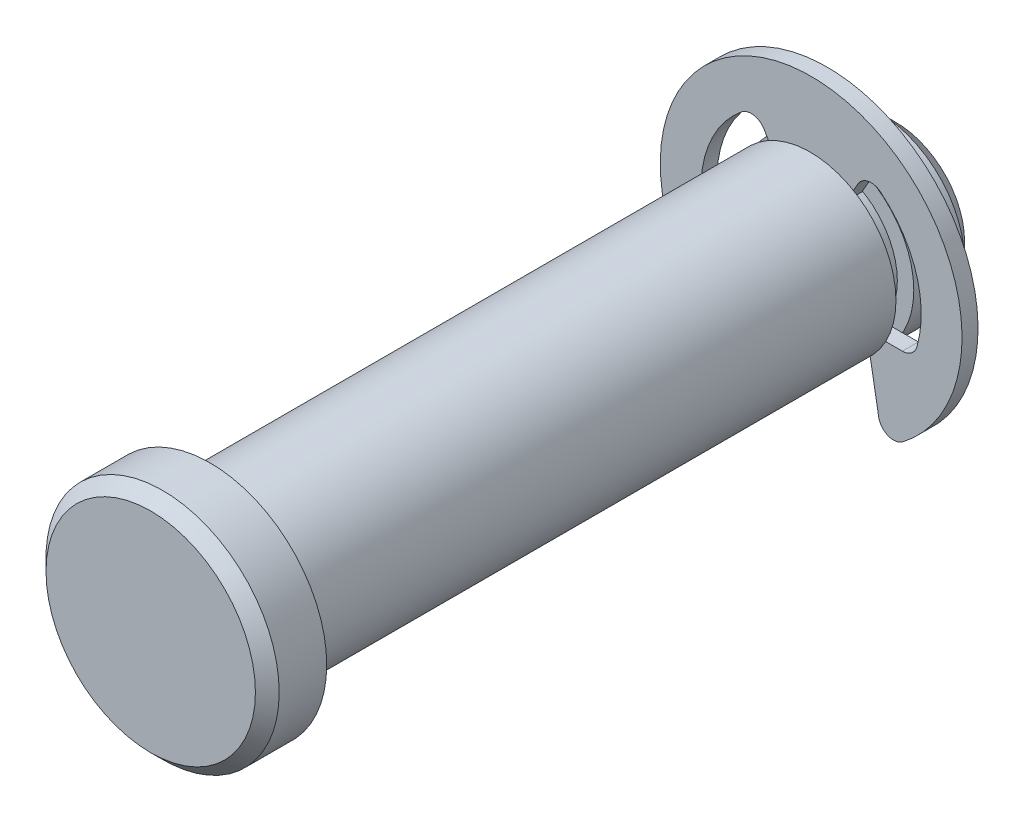
ISO-10303-21;
HEADER;
FILE_DESCRIPTION(('STEP AP214'),'2;1');
FILE_NAME('part.step','',(''),(''),'','','');
FILE_SCHEMA(('AUTOMOTIVE_DESIGN { 1 0 10303 214 1 1 1 1 }'));
ENDSEC;
DATA;
#1=APPLICATION_CONTEXT('core data for automotive mechanical design processes');
#2=APPLICATION_PROTOCOL_DEFINITION('international standard','automotive_design',2000,#1);
#3=PRODUCT_CONTEXT('',#1,'mechanical');
#4=PRODUCT('Part','Part','',(#3));
#5=PRODUCT_RELATED_PRODUCT_CATEGORY('part','',(#4));
#6=PRODUCT_DEFINITION_FORMATION('','',#4);
#7=PRODUCT_DEFINITION_CONTEXT('part definition',#1,'design');
#8=PRODUCT_DEFINITION('design','',#6,#7);
#9=PRODUCT_DEFINITION_SHAPE('','',#8);
#10=(LENGTH_UNIT() NAMED_UNIT(*) SI_UNIT(.MILLI.,.METRE.));
#11=(NAMED_UNIT(*) PLANE_ANGLE_UNIT() SI_UNIT($,.RADIAN.));
#12=(NAMED_UNIT(*) SI_UNIT($,.STERADIAN.) SOLID_ANGLE_UNIT());
#13=UNCERTAINTY_MEASURE_WITH_UNIT(LENGTH_MEASURE(1.E-05),#10,'distance_accuracy_value','');
#14=(GEOMETRIC_REPRESENTATION_CONTEXT(3) GLOBAL_UNCERTAINTY_ASSIGNED_CONTEXT((#13)) GLOBAL_UNIT_ASSIGNED_CONTEXT((#10,
#11,#12)) REPRESENTATION_CONTEXT('',''));
#15=CARTESIAN_POINT('',(0.,0.,0.));
#16=DIRECTION('',(0.,0.,1.));
#17=DIRECTION('',(1.,0.,0.));
#18=AXIS2_PLACEMENT_3D('',#15,#16,#17);
#19=CARTESIAN_POINT('',(0.,0.,-14.3383));
#20=DIRECTION('',(0.,0.,1.));
#21=DIRECTION('',(1.,0.,0.));
#22=AXIS2_PLACEMENT_3D('',#19,#20,#21);
#23=PLANE('',#22);
#24=DIRECTION('',(-0.173648177666931,0.984807753012208,0.));
#25=VECTOR('',#24,1.);
#26=CARTESIAN_POINT('',(2.59081415555905,0.45683043762648,-14.3383));
#27=LINE('',#26,#25);
#28=CARTESIAN_POINT('',(3.7540636467653,-6.14028525353106,-14.3383));
#29=VERTEX_POINT('',#28);
#30=CARTESIAN_POINT('',(3.07848,-2.30886,-14.3383));
#31=VERTEX_POINT('',#30);
#32=EDGE_CURVE('E200',#29,#31,#27,.T.);
#33=ORIENTED_EDGE('',*,*,#32,.F.);
#34=CARTESIAN_POINT('',(4.57952950534013,-5.99473335101063,-14.3383));
#35=DIRECTION('',(0.,0.,1.));
#36=DIRECTION('',(1.,0.,0.));
#37=AXIS2_PLACEMENT_3D('',#34,#35,#36);
#38=CIRCLE('',#37,0.8382);
#39=CARTESIAN_POINT('',(5.08836611704459,-6.66081483445626,-14.3383));
#40=VERTEX_POINT('',#39);
#41=EDGE_CURVE('E254',#29,#40,#38,.T.);
#42=ORIENTED_EDGE('',*,*,#41,.T.);
#43=CARTESIAN_POINT('',(0.,0.,-14.3383));
#44=DIRECTION('',(0.,0.,1.));
#45=DIRECTION('',(1.,0.,0.));
#46=AXIS2_PLACEMENT_3D('',#43,#44,#45);
#47=CIRCLE('',#46,8.382);
#48=CARTESIAN_POINT('',(-5.08836611704459,-6.66081483445626,-14.3383));
#49=VERTEX_POINT('',#48);
#50=EDGE_CURVE('E180',#40,#49,#47,.T.);
#51=ORIENTED_EDGE('',*,*,#50,.T.);
#52=CARTESIAN_POINT('',(-4.57952950534013,-5.99473335101063,-14.3383));
#53=DIRECTION('',(0.,0.,1.));
#54=DIRECTION('',(1.,0.,0.));
#55=AXIS2_PLACEMENT_3D('',#52,#53,#54);
#56=CIRCLE('',#55,0.8382);
#57=CARTESIAN_POINT('',(-3.7540636467653,-6.14028525353106,-14.3383));
#58=VERTEX_POINT('',#57);
#59=EDGE_CURVE('E252',#49,#58,#56,.T.);
#60=ORIENTED_EDGE('',*,*,#59,.T.);
#61=DIRECTION('',(-0.173648177666931,-0.984807753012208,0.));
#62=VECTOR('',#61,1.);
#63=CARTESIAN_POINT('',(-2.59081415555905,0.45683043762648,-14.3383));
#64=LINE('',#63,#62);
#65=CARTESIAN_POINT('',(-3.07848,-2.30886,-14.3383));
#66=VERTEX_POINT('',#65);
#67=EDGE_CURVE('E196',#66,#58,#64,.T.);
#68=ORIENTED_EDGE('',*,*,#67,.F.);
#69=DIRECTION('',(1.,0.,0.));
#70=VECTOR('',#69,1.);
#71=CARTESIAN_POINT('',(0.,-2.30886,-14.3383));
#72=LINE('',#71,#70);
#73=CARTESIAN_POINT('',(-5.06777121493265,-2.30886,-14.3383));
#74=VERTEX_POINT('',#73);
#75=EDGE_CURVE('E187',#74,#66,#72,.T.);
#76=ORIENTED_EDGE('',*,*,#75,.F.);
#77=CARTESIAN_POINT('',(-5.06777121493265,-1.47066,-14.3383));
#78=DIRECTION('',(0.,0.,1.));
#79=DIRECTION('',(1.,0.,0.));
#80=AXIS2_PLACEMENT_3D('',#77,#78,#79);
#81=CIRCLE('',#80,0.8382);
#82=CARTESIAN_POINT('',(-5.87276014438044,-1.70426664259928,-14.3383));
#83=VERTEX_POINT('',#82);
#84=EDGE_CURVE('E52',#74,#83,#81,.F.);
#85=ORIENTED_EDGE('',*,*,#84,.T.);
#86=CARTESIAN_POINT('',(0.,0.,-14.3383));
#87=DIRECTION('',(0.,0.,1.));
#88=DIRECTION('',(1.,0.,0.));
#89=AXIS2_PLACEMENT_3D('',#86,#87,#88);
#90=CIRCLE('',#89,6.11505);
#91=CARTESIAN_POINT('',(-3.85991365439078,4.74287919761273,-14.3383));
#92=VERTEX_POINT('',#91);
#93=EDGE_CURVE('E212',#92,#83,#90,.T.);
#94=ORIENTED_EDGE('',*,*,#93,.F.);
#95=CARTESIAN_POINT('',(-3.33082891671728,4.09276491507392,-14.3383));
#96=DIRECTION('',(0.,0.,1.));
#97=DIRECTION('',(1.,0.,0.));
#98=AXIS2_PLACEMENT_3D('',#95,#96,#97);
#99=CIRCLE('',#98,0.8382);
#100=CARTESIAN_POINT('',(-2.60492642326516,4.51186491507392,-14.3383));
#101=VERTEX_POINT('',#100);
#102=EDGE_CURVE('E184',#92,#101,#99,.F.);
#103=ORIENTED_EDGE('',*,*,#102,.T.);
#104=DIRECTION('',(-0.500000000000001,0.866025403784438,0.));
#105=VECTOR('',#104,1.);
#106=CARTESIAN_POINT('',(0.,0.,-14.3383));
#107=LINE('',#106,#105);
#108=CARTESIAN_POINT('',(-1.92405000000001,3.33255235630289,-14.3383));
#109=VERTEX_POINT('',#108);
#110=EDGE_CURVE('E176',#109,#101,#107,.T.);
#111=ORIENTED_EDGE('',*,*,#110,.F.);
#112=DIRECTION('',(1.,0.,0.));
#113=VECTOR('',#112,1.);
#114=CARTESIAN_POINT('',(-1.92405000000001,3.33255235630289,-14.3383));
#115=LINE('',#114,#113);
#116=CARTESIAN_POINT('',(1.92405000000001,3.33255235630289,-14.3383));
#117=VERTEX_POINT('',#116);
#118=EDGE_CURVE('E160',#109,#117,#115,.T.);
#119=ORIENTED_EDGE('',*,*,#118,.T.);
#120=DIRECTION('',(-0.500000000000001,-0.866025403784438,0.));
#121=VECTOR('',#120,1.);
#122=CARTESIAN_POINT('',(0.,0.,-14.3383));
#123=LINE('',#122,#121);
#124=CARTESIAN_POINT('',(2.60492642326516,4.51186491507392,-14.3383));
#125=VERTEX_POINT('',#124);
#126=EDGE_CURVE('E210',#125,#117,#123,.T.);
#127=ORIENTED_EDGE('',*,*,#126,.F.);
#128=CARTESIAN_POINT('',(3.33082891671728,4.09276491507392,-14.3383));
#129=DIRECTION('',(0.,0.,1.));
#130=DIRECTION('',(1.,0.,0.));
#131=AXIS2_PLACEMENT_3D('',#128,#129,#130);
#132=CIRCLE('',#131,0.8382);
#133=CARTESIAN_POINT('',(3.85991365439078,4.74287919761273,-14.3383));
#134=VERTEX_POINT('',#133);
#135=EDGE_CURVE('E269',#125,#134,#132,.F.);
#136=ORIENTED_EDGE('',*,*,#135,.T.);
#137=CARTESIAN_POINT('',(0.,0.,-14.3383));
#138=DIRECTION('',(0.,0.,1.));
#139=DIRECTION('',(1.,0.,0.));
#140=AXIS2_PLACEMENT_3D('',#137,#138,#139);
#141=CIRCLE('',#140,6.11505);
#142=CARTESIAN_POINT('',(5.87276014438044,-1.70426664259928,-14.3383));
#143=VERTEX_POINT('',#142);
#144=EDGE_CURVE('E215',#143,#134,#141,.T.);
#145=ORIENTED_EDGE('',*,*,#144,.F.);
#146=CARTESIAN_POINT('',(5.06777121493265,-1.47066,-14.3383));
#147=DIRECTION('',(0.,0.,1.));
#148=DIRECTION('',(1.,0.,0.));
#149=AXIS2_PLACEMENT_3D('',#146,#147,#148);
#150=CIRCLE('',#149,0.8382);
#151=CARTESIAN_POINT('',(5.06777121493265,-2.30886,-14.3383));
#152=VERTEX_POINT('',#151);
#153=EDGE_CURVE('E265',#143,#152,#150,.F.);
#154=ORIENTED_EDGE('',*,*,#153,.T.);
#155=DIRECTION('',(1.,0.,0.));
#156=VECTOR('',#155,1.);
#157=CARTESIAN_POINT('',(0.,-2.30886,-14.3383));
#158=LINE('',#157,#156);
#159=EDGE_CURVE('E205',#31,#152,#158,.T.);
#160=ORIENTED_EDGE('',*,*,#159,.F.);
#161=EDGE_LOOP('',(#33,#42,#51,#60,#68,#76,#85,#94,#103,#111,#119,#127,#136,#145,#154,#160));
#162=FACE_BOUND('',#161,.T.);
#163=ADVANCED_FACE('F44',(#162),#23,.T.);
#164=CARTESIAN_POINT('',(0.,0.,-15.2273));
#165=DIRECTION('',(0.,0.,1.));
#166=DIRECTION('',(1.,0.,0.));
#167=AXIS2_PLACEMENT_3D('',#164,#165,#166);
#168=PLANE('',#167);
#169=CARTESIAN_POINT('',(0.,0.,-15.2273));
#170=DIRECTION('',(0.,0.,1.));
#171=DIRECTION('',(1.,0.,0.));
#172=AXIS2_PLACEMENT_3D('',#169,#170,#171);
#173=CIRCLE('',#172,8.382);
#174=CARTESIAN_POINT('',(5.08836611704459,-6.66081483445626,-15.2273));
#175=VERTEX_POINT('',#174);
#176=CARTESIAN_POINT('',(-5.08836611704459,-6.66081483445626,-15.2273));
#177=VERTEX_POINT('',#176);
#178=EDGE_CURVE('E218',#175,#177,#173,.T.);
#179=ORIENTED_EDGE('',*,*,#178,.F.);
#180=CARTESIAN_POINT('',(4.57952950534013,-5.99473335101063,-15.2273));
#181=DIRECTION('',(0.,0.,1.));
#182=DIRECTION('',(1.,0.,0.));
#183=AXIS2_PLACEMENT_3D('',#180,#181,#182);
#184=CIRCLE('',#183,0.8382);
#185=CARTESIAN_POINT('',(3.7540636467653,-6.14028525353106,-15.2273));
#186=VERTEX_POINT('',#185);
#187=EDGE_CURVE('E262',#175,#186,#184,.F.);
#188=ORIENTED_EDGE('',*,*,#187,.T.);
#189=DIRECTION('',(-0.173648177666931,0.984807753012208,0.));
#190=VECTOR('',#189,1.);
#191=CARTESIAN_POINT('',(2.59081415555905,0.45683043762648,-15.2273));
#192=LINE('',#191,#190);
#193=CARTESIAN_POINT('',(3.07848,-2.30886,-15.2273));
#194=VERTEX_POINT('',#193);
#195=EDGE_CURVE('E198',#186,#194,#192,.T.);
#196=ORIENTED_EDGE('',*,*,#195,.T.);
#197=DIRECTION('',(1.,0.,0.));
#198=VECTOR('',#197,1.);
#199=CARTESIAN_POINT('',(0.,-2.30886,-15.2273));
#200=LINE('',#199,#198);
#201=CARTESIAN_POINT('',(5.06777121493265,-2.30886,-15.2273));
#202=VERTEX_POINT('',#201);
#203=EDGE_CURVE('E202',#194,#202,#200,.T.);
#204=ORIENTED_EDGE('',*,*,#203,.T.);
#205=CARTESIAN_POINT('',(5.06777121493265,-1.47066,-15.2273));
#206=DIRECTION('',(0.,0.,1.));
#207=DIRECTION('',(1.,0.,0.));
#208=AXIS2_PLACEMENT_3D('',#205,#206,#207);
#209=CIRCLE('',#208,0.8382);
#210=CARTESIAN_POINT('',(5.87276014438044,-1.70426664259928,-15.2273));
#211=VERTEX_POINT('',#210);
#212=EDGE_CURVE('E267',#202,#211,#209,.T.);
#213=ORIENTED_EDGE('',*,*,#212,.T.);
#214=CARTESIAN_POINT('',(0.,0.,-15.2273));
#215=DIRECTION('',(0.,0.,1.));
#216=DIRECTION('',(1.,0.,0.));
#217=AXIS2_PLACEMENT_3D('',#214,#215,#216);
#218=CIRCLE('',#217,6.11505);
#219=CARTESIAN_POINT('',(3.85991365439078,4.74287919761273,-15.2273));
#220=VERTEX_POINT('',#219);
#221=EDGE_CURVE('E226',#211,#220,#218,.T.);
#222=ORIENTED_EDGE('',*,*,#221,.T.);
#223=CARTESIAN_POINT('',(3.33082891671728,4.09276491507392,-15.2273));
#224=DIRECTION('',(0.,0.,1.));
#225=DIRECTION('',(1.,0.,0.));
#226=AXIS2_PLACEMENT_3D('',#223,#224,#225);
#227=CIRCLE('',#226,0.8382);
#228=CARTESIAN_POINT('',(2.60492642326516,4.51186491507392,-15.2273));
#229=VERTEX_POINT('',#228);
#230=EDGE_CURVE('E271',#220,#229,#227,.T.);
#231=ORIENTED_EDGE('',*,*,#230,.T.);
#232=DIRECTION('',(-0.500000000000001,-0.866025403784438,0.));
#233=VECTOR('',#232,1.);
#234=CARTESIAN_POINT('',(0.,0.,-15.2273));
#235=LINE('',#234,#233);
#236=CARTESIAN_POINT('',(1.92405000000001,3.33255235630289,-15.2273));
#237=VERTEX_POINT('',#236);
#238=EDGE_CURVE('E208',#229,#237,#235,.T.);
#239=ORIENTED_EDGE('',*,*,#238,.T.);
#240=DIRECTION('',(-1.,0.,0.));
#241=VECTOR('',#240,1.);
#242=CARTESIAN_POINT('',(-1.92405000000001,3.33255235630289,-15.2273));
#243=LINE('',#242,#241);
#244=CARTESIAN_POINT('',(-1.92405000000001,3.33255235630289,-15.2273));
#245=VERTEX_POINT('',#244);
#246=EDGE_CURVE('E171',#237,#245,#243,.T.);
#247=ORIENTED_EDGE('',*,*,#246,.T.);
#248=DIRECTION('',(-0.500000000000001,0.866025403784438,0.));
#249=VECTOR('',#248,1.);
#250=CARTESIAN_POINT('',(0.,0.,-15.2273));
#251=LINE('',#250,#249);
#252=CARTESIAN_POINT('',(-2.60492642326516,4.51186491507392,-15.2273));
#253=VERTEX_POINT('',#252);
#254=EDGE_CURVE('E179',#245,#253,#251,.T.);
#255=ORIENTED_EDGE('',*,*,#254,.T.);
#256=CARTESIAN_POINT('',(-3.33082891671728,4.09276491507392,-15.2273));
#257=DIRECTION('',(0.,0.,1.));
#258=DIRECTION('',(1.,0.,0.));
#259=AXIS2_PLACEMENT_3D('',#256,#257,#258);
#260=CIRCLE('',#259,0.8382);
#261=CARTESIAN_POINT('',(-3.85991365439078,4.74287919761273,-15.2273));
#262=VERTEX_POINT('',#261);
#263=EDGE_CURVE('E274',#253,#262,#260,.T.);
#264=ORIENTED_EDGE('',*,*,#263,.T.);
#265=CARTESIAN_POINT('',(0.,0.,-15.2273));
#266=DIRECTION('',(0.,0.,1.));
#267=DIRECTION('',(1.,0.,0.));
#268=AXIS2_PLACEMENT_3D('',#265,#266,#267);
#269=CIRCLE('',#268,6.11505);
#270=CARTESIAN_POINT('',(-5.87276014438044,-1.70426664259928,-15.2273));
#271=VERTEX_POINT('',#270);
#272=EDGE_CURVE('E223',#262,#271,#269,.T.);
#273=ORIENTED_EDGE('',*,*,#272,.T.);
#274=CARTESIAN_POINT('',(-5.06777121493265,-1.47066,-15.2273));
#275=DIRECTION('',(0.,0.,1.));
#276=DIRECTION('',(1.,0.,0.));
#277=AXIS2_PLACEMENT_3D('',#274,#275,#276);
#278=CIRCLE('',#277,0.8382);
#279=CARTESIAN_POINT('',(-5.06777121493265,-2.30886,-15.2273));
#280=VERTEX_POINT('',#279);
#281=EDGE_CURVE('E12',#271,#280,#278,.T.);
#282=ORIENTED_EDGE('',*,*,#281,.T.);
#283=DIRECTION('',(1.,0.,0.));
#284=VECTOR('',#283,1.);
#285=CARTESIAN_POINT('',(0.,-2.30886,-15.2273));
#286=LINE('',#285,#284);
#287=CARTESIAN_POINT('',(-3.07848,-2.30886,-15.2273));
#288=VERTEX_POINT('',#287);
#289=EDGE_CURVE('E185',#280,#288,#286,.T.);
#290=ORIENTED_EDGE('',*,*,#289,.T.);
#291=DIRECTION('',(-0.173648177666931,-0.984807753012208,0.));
#292=VECTOR('',#291,1.);
#293=CARTESIAN_POINT('',(-2.59081415555905,0.45683043762648,-15.2273));
#294=LINE('',#293,#292);
#295=CARTESIAN_POINT('',(-3.7540636467653,-6.14028525353106,-15.2273));
#296=VERTEX_POINT('',#295);
#297=EDGE_CURVE('E194',#288,#296,#294,.T.);
#298=ORIENTED_EDGE('',*,*,#297,.T.);
#299=CARTESIAN_POINT('',(-4.57952950534013,-5.99473335101063,-15.2273));
#300=DIRECTION('',(0.,0.,1.));
#301=DIRECTION('',(1.,0.,0.));
#302=AXIS2_PLACEMENT_3D('',#299,#300,#301);
#303=CIRCLE('',#302,0.8382);
#304=EDGE_CURVE('E66',#296,#177,#303,.F.);
#305=ORIENTED_EDGE('',*,*,#304,.T.);
#306=EDGE_LOOP('',(#179,#188,#196,#204,#213,#222,#231,#239,#247,#255,#264,#273,#282,#290,#298,#305));
#307=FACE_BOUND('',#306,.T.);
#308=ADVANCED_FACE('F287',(#307),#168,.F.);
#309=CARTESIAN_POINT('',(0.,0.,-14.3383));
#310=DIRECTION('',(0.,0.,-1.));
#311=DIRECTION('',(-1.,0.,0.));
#312=AXIS2_PLACEMENT_3D('',#309,#310,#311);
#313=CYLINDRICAL_SURFACE('',#312,8.382);
#314=ORIENTED_EDGE('',*,*,#50,.F.);
#315=DIRECTION('',(0.,0.,-1.));
#316=VECTOR('',#315,1.);
#317=CARTESIAN_POINT('',(5.08836611704459,-6.66081483445626,-14.3383));
#318=LINE('',#317,#316);
#319=EDGE_CURVE('E259',#40,#175,#318,.T.);
#320=ORIENTED_EDGE('',*,*,#319,.T.);
#321=ORIENTED_EDGE('',*,*,#178,.T.);
#322=DIRECTION('',(0.,0.,-1.));
#323=VECTOR('',#322,1.);
#324=CARTESIAN_POINT('',(-5.08836611704459,-6.66081483445626,-14.3383));
#325=LINE('',#324,#323);
#326=EDGE_CURVE('E256',#177,#49,#325,.F.);
#327=ORIENTED_EDGE('',*,*,#326,.T.);
#328=EDGE_LOOP('',(#314,#320,#321,#327));
#329=FACE_BOUND('',#328,.T.);
#330=ADVANCED_FACE('F327',(#329),#313,.T.);
#331=CARTESIAN_POINT('',(-3.07848,-2.30886,-19.05));
#332=DIRECTION('',(-0.984807753012208,0.173648177666931,0.));
#333=DIRECTION('',(-0.173648177666931,-0.984807753012208,0.));
#334=AXIS2_PLACEMENT_3D('',#331,#332,#333);
#335=PLANE('',#334);
#336=ORIENTED_EDGE('',*,*,#67,.T.);
#337=DIRECTION('',(0.,0.,-1.));
#338=VECTOR('',#337,1.);
#339=CARTESIAN_POINT('',(-3.7540636467653,-6.14028525353106,-19.05));
#340=LINE('',#339,#338);
#341=EDGE_CURVE('E59',#58,#296,#340,.T.);
#342=ORIENTED_EDGE('',*,*,#341,.T.);
#343=ORIENTED_EDGE('',*,*,#297,.F.);
#344=DIRECTION('',(0.,0.,1.));
#345=VECTOR('',#344,1.);
#346=CARTESIAN_POINT('',(-3.07848,-2.30886,-19.05));
#347=LINE('',#346,#345);
#348=EDGE_CURVE('E292',#288,#66,#347,.T.);
#349=ORIENTED_EDGE('',*,*,#348,.T.);
#350=EDGE_LOOP('',(#336,#342,#343,#349));
#351=FACE_BOUND('',#350,.T.);
#352=ADVANCED_FACE('F332',(#351),#335,.F.);
#353=CARTESIAN_POINT('',(-3.05752500000001,5.29578864541203,-19.05));
#354=DIRECTION('',(0.866025403784438,0.500000000000001,0.));
#355=DIRECTION('',(-0.500000000000001,0.866025403784438,0.));
#356=AXIS2_PLACEMENT_3D('',#353,#354,#355);
#357=PLANE('',#356);
#358=ORIENTED_EDGE('',*,*,#110,.T.);
#359=DIRECTION('',(0.,0.,-1.));
#360=VECTOR('',#359,1.);
#361=CARTESIAN_POINT('',(-2.60492642326516,4.51186491507392,-15.2273));
#362=LINE('',#361,#360);
#363=EDGE_CURVE('E244',#101,#253,#362,.T.);
#364=ORIENTED_EDGE('',*,*,#363,.T.);
#365=ORIENTED_EDGE('',*,*,#254,.F.);
#366=DIRECTION('',(0.,0.,-1.));
#367=VECTOR('',#366,1.);
#368=CARTESIAN_POINT('',(-1.92405000000001,3.33255235630289,-14.3383));
#369=LINE('',#368,#367);
#370=EDGE_CURVE('E164',#245,#109,#369,.F.);
#371=ORIENTED_EDGE('',*,*,#370,.T.);
#372=EDGE_LOOP('',(#358,#364,#365,#371));
#373=FACE_BOUND('',#372,.T.);
#374=ADVANCED_FACE('F175',(#373),#357,.F.);
#375=CARTESIAN_POINT('',(0.,0.,-19.05));
#376=DIRECTION('',(0.,0.,1.));
#377=DIRECTION('',(1.,0.,0.));
#378=AXIS2_PLACEMENT_3D('',#375,#376,#377);
#379=CYLINDRICAL_SURFACE('',#378,6.11505);
#380=ORIENTED_EDGE('',*,*,#272,.F.);
#381=DIRECTION('',(0.,0.,1.));
#382=VECTOR('',#381,1.);
#383=CARTESIAN_POINT('',(-3.85991365439078,4.74287919761273,-19.05));
#384=LINE('',#383,#382);
#385=EDGE_CURVE('E241',#262,#92,#384,.T.);
#386=ORIENTED_EDGE('',*,*,#385,.T.);
#387=ORIENTED_EDGE('',*,*,#93,.T.);
#388=DIRECTION('',(0.,0.,1.));
#389=VECTOR('',#388,1.);
#390=CARTESIAN_POINT('',(-5.87276014438044,-1.70426664259928,-19.05));
#391=LINE('',#390,#389);
#392=EDGE_CURVE('E239',#83,#271,#391,.F.);
#393=ORIENTED_EDGE('',*,*,#392,.T.);
#394=EDGE_LOOP('',(#380,#386,#387,#393));
#395=FACE_BOUND('',#394,.T.);
#396=ADVANCED_FACE('F282',(#395),#379,.F.);
#397=CARTESIAN_POINT('',(-5.66242015421851,-2.30886,-19.05));
#398=DIRECTION('',(0.,-1.,0.));
#399=DIRECTION('',(0.,0.,-1.));
#400=AXIS2_PLACEMENT_3D('',#397,#398,#399);
#401=PLANE('',#400);
#402=ORIENTED_EDGE('',*,*,#289,.F.);
#403=DIRECTION('',(0.,0.,-1.));
#404=VECTOR('',#403,1.);
#405=CARTESIAN_POINT('',(-5.06777121493265,-2.30886,-14.3383));
#406=LINE('',#405,#404);
#407=EDGE_CURVE('E246',#280,#74,#406,.F.);
#408=ORIENTED_EDGE('',*,*,#407,.T.);
#409=ORIENTED_EDGE('',*,*,#75,.T.);
#410=ORIENTED_EDGE('',*,*,#348,.F.);
#411=EDGE_LOOP('',(#402,#408,#409,#410));
#412=FACE_BOUND('',#411,.T.);
#413=ADVANCED_FACE('F290',(#412),#401,.F.);
#414=CARTESIAN_POINT('',(0.,0.,-19.05));
#415=DIRECTION('',(0.,0.,1.));
#416=DIRECTION('',(1.,0.,0.));
#417=AXIS2_PLACEMENT_3D('',#414,#415,#416);
#418=CYLINDRICAL_SURFACE('',#417,6.11505);
#419=ORIENTED_EDGE('',*,*,#221,.F.);
#420=DIRECTION('',(0.,0.,1.));
#421=VECTOR('',#420,1.);
#422=CARTESIAN_POINT('',(5.87276014438044,-1.70426664259928,-19.05));
#423=LINE('',#422,#421);
#424=EDGE_CURVE('E231',#211,#143,#423,.T.);
#425=ORIENTED_EDGE('',*,*,#424,.T.);
#426=ORIENTED_EDGE('',*,*,#144,.T.);
#427=DIRECTION('',(0.,0.,1.));
#428=VECTOR('',#427,1.);
#429=CARTESIAN_POINT('',(3.85991365439078,4.74287919761273,-19.05));
#430=LINE('',#429,#428);
#431=EDGE_CURVE('E229',#134,#220,#430,.F.);
#432=ORIENTED_EDGE('',*,*,#431,.T.);
#433=EDGE_LOOP('',(#419,#425,#426,#432));
#434=FACE_BOUND('',#433,.T.);
#435=ADVANCED_FACE('F306',(#434),#418,.F.);
#436=CARTESIAN_POINT('',(3.07848,-2.30886,-19.05));
#437=DIRECTION('',(0.,-1.,0.));
#438=DIRECTION('',(0.,0.,-1.));
#439=AXIS2_PLACEMENT_3D('',#436,#437,#438);
#440=PLANE('',#439);
#441=ORIENTED_EDGE('',*,*,#159,.T.);
#442=DIRECTION('',(0.,0.,-1.));
#443=VECTOR('',#442,1.);
#444=CARTESIAN_POINT('',(5.06777121493265,-2.30886,-15.2273));
#445=LINE('',#444,#443);
#446=EDGE_CURVE('E234',#152,#202,#445,.T.);
#447=ORIENTED_EDGE('',*,*,#446,.T.);
#448=ORIENTED_EDGE('',*,*,#203,.F.);
#449=DIRECTION('',(0.,0.,1.));
#450=VECTOR('',#449,1.);
#451=CARTESIAN_POINT('',(3.07848,-2.30886,-19.05));
#452=LINE('',#451,#450);
#453=EDGE_CURVE('E189',#194,#31,#452,.T.);
#454=ORIENTED_EDGE('',*,*,#453,.T.);
#455=EDGE_LOOP('',(#441,#447,#448,#454));
#456=FACE_BOUND('',#455,.T.);
#457=ADVANCED_FACE('F316',(#456),#440,.F.);
#458=CARTESIAN_POINT('',(3.07848,-2.30886,-19.05));
#459=DIRECTION('',(0.984807753012208,0.173648177666931,0.));
#460=DIRECTION('',(-0.173648177666931,0.984807753012208,0.));
#461=AXIS2_PLACEMENT_3D('',#458,#459,#460);
#462=PLANE('',#461);
#463=ORIENTED_EDGE('',*,*,#195,.F.);
#464=DIRECTION('',(0.,0.,-1.));
#465=VECTOR('',#464,1.);
#466=CARTESIAN_POINT('',(3.7540636467653,-6.14028525353106,-19.05));
#467=LINE('',#466,#465);
#468=EDGE_CURVE('E249',#186,#29,#467,.F.);
#469=ORIENTED_EDGE('',*,*,#468,.T.);
#470=ORIENTED_EDGE('',*,*,#32,.T.);
#471=ORIENTED_EDGE('',*,*,#453,.F.);
#472=EDGE_LOOP('',(#463,#469,#470,#471));
#473=FACE_BOUND('',#472,.T.);
#474=ADVANCED_FACE('F321',(#473),#462,.F.);
#475=CARTESIAN_POINT('',(0.,0.,-19.05));
#476=DIRECTION('',(-0.866025403784438,0.500000000000001,0.));
#477=DIRECTION('',(-0.500000000000001,-0.866025403784438,0.));
#478=AXIS2_PLACEMENT_3D('',#475,#476,#477);
#479=PLANE('',#478);
#480=ORIENTED_EDGE('',*,*,#238,.F.);
#481=DIRECTION('',(0.,0.,-1.));
#482=VECTOR('',#481,1.);
#483=CARTESIAN_POINT('',(2.60492642326516,4.51186491507392,-14.3383));
#484=LINE('',#483,#482);
#485=EDGE_CURVE('E236',#229,#125,#484,.F.);
#486=ORIENTED_EDGE('',*,*,#485,.T.);
#487=ORIENTED_EDGE('',*,*,#126,.T.);
#488=DIRECTION('',(0.,0.,-1.));
#489=VECTOR('',#488,1.);
#490=CARTESIAN_POINT('',(1.92405000000001,3.33255235630289,-14.3383));
#491=LINE('',#490,#489);
#492=EDGE_CURVE('E167',#117,#237,#491,.T.);
#493=ORIENTED_EDGE('',*,*,#492,.T.);
#494=EDGE_LOOP('',(#480,#486,#487,#493));
#495=FACE_BOUND('',#494,.T.);
#496=ADVANCED_FACE('F299',(#495),#479,.F.);
#497=CARTESIAN_POINT('',(-1.92405000000001,3.33255235630289,-19.1097815495919));
#498=DIRECTION('',(0.,-1.,0.));
#499=DIRECTION('',(0.,0.,-1.));
#500=AXIS2_PLACEMENT_3D('',#497,#498,#499);
#501=PLANE('',#500);
#502=ORIENTED_EDGE('',*,*,#246,.F.);
#503=ORIENTED_EDGE('',*,*,#492,.F.);
#504=ORIENTED_EDGE('',*,*,#118,.F.);
#505=ORIENTED_EDGE('',*,*,#370,.F.);
#506=EDGE_LOOP('',(#502,#503,#504,#505));
#507=FACE_BOUND('',#506,.T.);
#508=ADVANCED_FACE('F163',(#507),#501,.T.);
#509=CARTESIAN_POINT('',(5.06777121493265,-1.47066,-19.05));
#510=DIRECTION('',(0.,0.,1.));
#511=DIRECTION('',(1.,0.,0.));
#512=AXIS2_PLACEMENT_3D('',#509,#510,#511);
#513=CYLINDRICAL_SURFACE('',#512,0.8382);
#514=ORIENTED_EDGE('',*,*,#212,.F.);
#515=ORIENTED_EDGE('',*,*,#446,.F.);
#516=ORIENTED_EDGE('',*,*,#153,.F.);
#517=ORIENTED_EDGE('',*,*,#424,.F.);
#518=EDGE_LOOP('',(#514,#515,#516,#517));
#519=FACE_BOUND('',#518,.T.);
#520=ADVANCED_FACE('F312',(#519),#513,.F.);
#521=CARTESIAN_POINT('',(3.33082891671728,4.09276491507392,-19.05));
#522=DIRECTION('',(0.,0.,1.));
#523=DIRECTION('',(1.,0.,0.));
#524=AXIS2_PLACEMENT_3D('',#521,#522,#523);
#525=CYLINDRICAL_SURFACE('',#524,0.8382);
#526=ORIENTED_EDGE('',*,*,#230,.F.);
#527=ORIENTED_EDGE('',*,*,#431,.F.);
#528=ORIENTED_EDGE('',*,*,#135,.F.);
#529=ORIENTED_EDGE('',*,*,#485,.F.);
#530=EDGE_LOOP('',(#526,#527,#528,#529));
#531=FACE_BOUND('',#530,.T.);
#532=ADVANCED_FACE('F309',(#531),#525,.F.);
#533=CARTESIAN_POINT('',(-3.33082891671728,4.09276491507392,-19.05));
#534=DIRECTION('',(0.,0.,1.));
#535=DIRECTION('',(1.,0.,0.));
#536=AXIS2_PLACEMENT_3D('',#533,#534,#535);
#537=CYLINDRICAL_SURFACE('',#536,0.8382);
#538=ORIENTED_EDGE('',*,*,#263,.F.);
#539=ORIENTED_EDGE('',*,*,#363,.F.);
#540=ORIENTED_EDGE('',*,*,#102,.F.);
#541=ORIENTED_EDGE('',*,*,#385,.F.);
#542=EDGE_LOOP('',(#538,#539,#540,#541));
#543=FACE_BOUND('',#542,.T.);
#544=ADVANCED_FACE('F355',(#543),#537,.F.);
#545=CARTESIAN_POINT('',(-5.06777121493265,-1.47066,-19.05));
#546=DIRECTION('',(0.,0.,1.));
#547=DIRECTION('',(1.,0.,0.));
#548=AXIS2_PLACEMENT_3D('',#545,#546,#547);
#549=CYLINDRICAL_SURFACE('',#548,0.8382);
#550=ORIENTED_EDGE('',*,*,#281,.F.);
#551=ORIENTED_EDGE('',*,*,#392,.F.);
#552=ORIENTED_EDGE('',*,*,#84,.F.);
#553=ORIENTED_EDGE('',*,*,#407,.F.);
#554=EDGE_LOOP('',(#550,#551,#552,#553));
#555=FACE_BOUND('',#554,.T.);
#556=ADVANCED_FACE('F285',(#555),#549,.F.);
#557=CARTESIAN_POINT('',(4.57952950534013,-5.99473335101063,-14.3383));
#558=DIRECTION('',(0.,0.,-1.));
#559=DIRECTION('',(-1.,0.,0.));
#560=AXIS2_PLACEMENT_3D('',#557,#558,#559);
#561=CYLINDRICAL_SURFACE('',#560,0.8382);
#562=ORIENTED_EDGE('',*,*,#187,.F.);
#563=ORIENTED_EDGE('',*,*,#319,.F.);
#564=ORIENTED_EDGE('',*,*,#41,.F.);
#565=ORIENTED_EDGE('',*,*,#468,.F.);
#566=EDGE_LOOP('',(#562,#563,#564,#565));
#567=FACE_BOUND('',#566,.T.);
#568=ADVANCED_FACE('F330',(#567),#561,.T.);
#569=CARTESIAN_POINT('',(-4.57952950534013,-5.99473335101063,-14.3383));
#570=DIRECTION('',(0.,0.,-1.));
#571=DIRECTION('',(-1.,0.,0.));
#572=AXIS2_PLACEMENT_3D('',#569,#570,#571);
#573=CYLINDRICAL_SURFACE('',#572,0.8382);
#574=ORIENTED_EDGE('',*,*,#304,.F.);
#575=ORIENTED_EDGE('',*,*,#341,.F.);
#576=ORIENTED_EDGE('',*,*,#59,.F.);
#577=ORIENTED_EDGE('',*,*,#326,.F.);
#578=EDGE_LOOP('',(#574,#575,#576,#577));
#579=FACE_BOUND('',#578,.T.);
#580=ADVANCED_FACE('F46',(#579),#573,.T.);
#581=CLOSED_SHELL('',(#163,#308,#330,#352,#374,#396,#413,#435,#457,#474,#496,#508,#520,#532,
#544,#556,#568,#580));
#582=MANIFOLD_SOLID_BREP('B2',#581);
#583=CARTESIAN_POINT('',(0.,0.,19.05));
#584=DIRECTION('',(0.,0.,-1.));
#585=DIRECTION('',(-1.,0.,0.));
#586=AXIS2_PLACEMENT_3D('',#583,#584,#585);
#587=CYLINDRICAL_SURFACE('',#586,4.7625);
#588=CARTESIAN_POINT('',(0.,0.,19.05));
#589=DIRECTION('',(0.,0.,1.));
#590=DIRECTION('',(1.,0.,0.));
#591=AXIS2_PLACEMENT_3D('',#588,#589,#590);
#592=CIRCLE('',#591,4.7625);
#593=CARTESIAN_POINT('',(4.7625,0.,19.05));
#594=VERTEX_POINT('',#593);
#595=EDGE_CURVE('E505',#594,#594,#592,.T.);
#596=ORIENTED_EDGE('',*,*,#595,.F.);
#597=EDGE_LOOP('',(#596));
#598=FACE_BOUND('',#597,.T.);
#599=CARTESIAN_POINT('',(0.,0.,-14.2875));
#600=DIRECTION('',(0.,0.,1.));
#601=DIRECTION('',(1.,0.,0.));
#602=AXIS2_PLACEMENT_3D('',#599,#600,#601);
#603=CIRCLE('',#602,4.7625);
#604=CARTESIAN_POINT('',(4.7625,0.,-14.2875));
#605=VERTEX_POINT('',#604);
#606=EDGE_CURVE('E517',#605,#605,#603,.T.);
#607=ORIENTED_EDGE('',*,*,#606,.T.);
#608=EDGE_LOOP('',(#607));
#609=FACE_BOUND('',#608,.T.);
#610=ADVANCED_FACE('F485',(#598,#609),#587,.T.);
#611=CARTESIAN_POINT('',(0.,4.7625,-14.2875));
#612=DIRECTION('',(0.,0.,-1.));
#613=DIRECTION('',(-1.,0.,0.));
#614=AXIS2_PLACEMENT_3D('',#611,#612,#613);
#615=PLANE('',#614);
#616=CARTESIAN_POINT('',(0.,0.,-14.2875));
#617=DIRECTION('',(0.,0.,1.));
#618=DIRECTION('',(1.,0.,0.));
#619=AXIS2_PLACEMENT_3D('',#616,#617,#618);
#620=CIRCLE('',#619,3.8481);
#621=CARTESIAN_POINT('',(3.8481,0.,-14.2875));
#622=VERTEX_POINT('',#621);
#623=EDGE_CURVE('E508',#622,#622,#620,.T.);
#624=ORIENTED_EDGE('',*,*,#623,.T.);
#625=EDGE_LOOP('',(#624));
#626=FACE_BOUND('',#625,.T.);
#627=ORIENTED_EDGE('',*,*,#606,.F.);
#628=EDGE_LOOP('',(#627));
#629=FACE_BOUND('',#628,.T.);
#630=ADVANCED_FACE('F535',(#626,#629),#615,.T.);
#631=CARTESIAN_POINT('',(0.,0.,19.05));
#632=DIRECTION('',(0.,0.,1.));
#633=DIRECTION('',(1.,0.,0.));
#634=AXIS2_PLACEMENT_3D('',#631,#632,#633);
#635=CYLINDRICAL_SURFACE('',#634,3.8481);
#636=CARTESIAN_POINT('',(0.,0.,-15.2781));
#637=DIRECTION('',(0.,0.,1.));
#638=DIRECTION('',(1.,0.,0.));
#639=AXIS2_PLACEMENT_3D('',#636,#637,#638);
#640=CIRCLE('',#639,3.8481);
#641=CARTESIAN_POINT('',(3.8481,0.,-15.2781));
#642=VERTEX_POINT('',#641);
#643=EDGE_CURVE('E511',#642,#642,#640,.T.);
#644=ORIENTED_EDGE('',*,*,#643,.T.);
#645=EDGE_LOOP('',(#644));
#646=FACE_BOUND('',#645,.T.);
#647=ORIENTED_EDGE('',*,*,#623,.F.);
#648=EDGE_LOOP('',(#647));
#649=FACE_BOUND('',#648,.T.);
#650=ADVANCED_FACE('F540',(#646,#649),#635,.T.);
#651=CARTESIAN_POINT('',(0.,4.7625,-15.2781));
#652=DIRECTION('',(0.,0.,1.));
#653=DIRECTION('',(1.,0.,0.));
#654=AXIS2_PLACEMENT_3D('',#651,#652,#653);
#655=PLANE('',#654);
#656=CARTESIAN_POINT('',(0.,0.,-15.2781));
#657=DIRECTION('',(0.,0.,1.));
#658=DIRECTION('',(1.,0.,0.));
#659=AXIS2_PLACEMENT_3D('',#656,#657,#658);
#660=CIRCLE('',#659,4.7625);
#661=CARTESIAN_POINT('',(4.7625,0.,-15.2781));
#662=VERTEX_POINT('',#661);
#663=EDGE_CURVE('E514',#662,#662,#660,.T.);
#664=ORIENTED_EDGE('',*,*,#663,.T.);
#665=EDGE_LOOP('',(#664));
#666=FACE_BOUND('',#665,.T.);
#667=ORIENTED_EDGE('',*,*,#643,.F.);
#668=EDGE_LOOP('',(#667));
#669=FACE_BOUND('',#668,.T.);
#670=ADVANCED_FACE('F546',(#666,#669),#655,.T.);
#671=CARTESIAN_POINT('',(0.,0.,-19.05));
#672=DIRECTION('',(0.,0.,1.));
#673=DIRECTION('',(1.,0.,0.));
#674=AXIS2_PLACEMENT_3D('',#671,#672,#673);
#675=PLANE('',#674);
#676=CARTESIAN_POINT('',(0.,0.,-19.05));
#677=DIRECTION('',(0.,0.,1.));
#678=DIRECTION('',(1.,0.,0.));
#679=AXIS2_PLACEMENT_3D('',#676,#677,#678);
#680=CIRCLE('',#679,3.80999999999995);
#681=CARTESIAN_POINT('',(3.80999999999995,0.,-19.05));
#682=VERTEX_POINT('',#681);
#683=EDGE_CURVE('E43',#682,#682,#680,.F.);
#684=ORIENTED_EDGE('',*,*,#683,.T.);
#685=EDGE_LOOP('',(#684));
#686=FACE_BOUND('',#685,.T.);
#687=ADVANCED_FACE('F551',(#686),#675,.F.);
#688=CARTESIAN_POINT('',(0.,0.,-18.0975));
#689=DIRECTION('',(0.,0.,1.));
#690=DIRECTION('',(1.,0.,0.));
#691=AXIS2_PLACEMENT_3D('',#688,#689,#690);
#692=CIRCLE('',#691,4.7625);
#693=CARTESIAN_POINT('',(4.7625,0.,-18.0975));
#694=VERTEX_POINT('',#693);
#695=EDGE_CURVE('E492',#694,#694,#692,.T.);
#696=ORIENTED_EDGE('',*,*,#695,.T.);
#697=EDGE_LOOP('',(#696));
#698=FACE_BOUND('',#697,.T.);
#699=ORIENTED_EDGE('',*,*,#663,.F.);
#700=EDGE_LOOP('',(#699));
#701=FACE_BOUND('',#700,.T.);
#702=ADVANCED_FACE('F529',(#698,#701),#587,.T.);
#703=CARTESIAN_POINT('',(0.,0.,19.05));
#704=DIRECTION('',(0.,0.,1.));
#705=DIRECTION('',(1.,0.,0.));
#706=AXIS2_PLACEMENT_3D('',#703,#704,#705);
#707=PLANE('',#706);
#708=CARTESIAN_POINT('',(0.,0.,19.05));
#709=DIRECTION('',(0.,0.,1.));
#710=DIRECTION('',(1.,0.,0.));
#711=AXIS2_PLACEMENT_3D('',#708,#709,#710);
#712=CIRCLE('',#711,6.477);
#713=CARTESIAN_POINT('',(6.477,0.,19.05));
#714=VERTEX_POINT('',#713);
#715=EDGE_CURVE('E520',#714,#714,#712,.T.);
#716=ORIENTED_EDGE('',*,*,#715,.F.);
#717=EDGE_LOOP('',(#716));
#718=FACE_BOUND('',#717,.T.);
#719=ORIENTED_EDGE('',*,*,#595,.T.);
#720=EDGE_LOOP('',(#719));
#721=FACE_BOUND('',#720,.T.);
#722=ADVANCED_FACE('F526',(#718,#721),#707,.F.);
#723=CARTESIAN_POINT('',(0.,0.,22.352));
#724=DIRECTION('',(0.,0.,-1.));
#725=DIRECTION('',(-1.,0.,0.));
#726=AXIS2_PLACEMENT_3D('',#723,#724,#725);
#727=CYLINDRICAL_SURFACE('',#726,6.477);
#728=CARTESIAN_POINT('',(0.,0.,21.6916));
#729=DIRECTION('',(0.,0.,1.));
#730=DIRECTION('',(1.,0.,0.));
#731=AXIS2_PLACEMENT_3D('',#728,#729,#730);
#732=CIRCLE('',#731,6.477);
#733=CARTESIAN_POINT('',(6.477,0.,21.6916));
#734=VERTEX_POINT('',#733);
#735=EDGE_CURVE('E496',#734,#734,#732,.F.);
#736=ORIENTED_EDGE('',*,*,#735,.T.);
#737=EDGE_LOOP('',(#736));
#738=FACE_BOUND('',#737,.T.);
#739=ORIENTED_EDGE('',*,*,#715,.T.);
#740=EDGE_LOOP('',(#739));
#741=FACE_BOUND('',#740,.T.);
#742=ADVANCED_FACE('F524',(#738,#741),#727,.T.);
#743=CARTESIAN_POINT('',(0.,0.,22.352));
#744=DIRECTION('',(0.,0.,1.));
#745=DIRECTION('',(1.,0.,0.));
#746=AXIS2_PLACEMENT_3D('',#743,#744,#745);
#747=PLANE('',#746);
#748=CARTESIAN_POINT('',(0.,0.,22.352));
#749=DIRECTION('',(0.,0.,1.));
#750=DIRECTION('',(1.,0.,0.));
#751=AXIS2_PLACEMENT_3D('',#748,#749,#750);
#752=CIRCLE('',#751,5.81660000000003);
#753=CARTESIAN_POINT('',(5.81660000000003,0.,22.352));
#754=VERTEX_POINT('',#753);
#755=EDGE_CURVE('E500',#754,#754,#752,.T.);
#756=ORIENTED_EDGE('',*,*,#755,.T.);
#757=EDGE_LOOP('',(#756));
#758=FACE_BOUND('',#757,.T.);
#759=ADVANCED_FACE('F555',(#758),#747,.T.);
#760=CARTESIAN_POINT('',(0.,0.,22.352));
#761=DIRECTION('',(0.,0.,-1.));
#762=DIRECTION('',(-1.,0.,0.));
#763=AXIS2_PLACEMENT_3D('',#760,#761,#762);
#764=CONICAL_SURFACE('',#763,5.81660000000003,0.785398163397444);
#765=ORIENTED_EDGE('',*,*,#735,.F.);
#766=EDGE_LOOP('',(#765));
#767=FACE_BOUND('',#766,.T.);
#768=ORIENTED_EDGE('',*,*,#755,.F.);
#769=EDGE_LOOP('',(#768));
#770=FACE_BOUND('',#769,.T.);
#771=ADVANCED_FACE('F553',(#767,#770),#764,.T.);
#772=CARTESIAN_POINT('',(0.,0.,-18.0975));
#773=DIRECTION('',(0.,0.,1.));
#774=DIRECTION('',(1.,0.,0.));
#775=AXIS2_PLACEMENT_3D('',#772,#773,#774);
#776=CONICAL_SURFACE('',#775,4.7625,0.785398163397451);
#777=ORIENTED_EDGE('',*,*,#683,.F.);
#778=EDGE_LOOP('',(#777));
#779=FACE_BOUND('',#778,.T.);
#780=ORIENTED_EDGE('',*,*,#695,.F.);
#781=EDGE_LOOP('',(#780));
#782=FACE_BOUND('',#781,.T.);
#783=ADVANCED_FACE('F487',(#779,#782),#776,.T.);
#784=CLOSED_SHELL('',(#610,#630,#650,#670,#687,#702,#722,#742,#759,#771,#783));
#785=MANIFOLD_SOLID_BREP('B6',#784);
#786=ADVANCED_BREP_SHAPE_REPRESENTATION('',(#18,#582,#785),#14);
#787=SHAPE_DEFINITION_REPRESENTATION(#9,#786);
ENDSEC;
END-ISO-10303-21;
